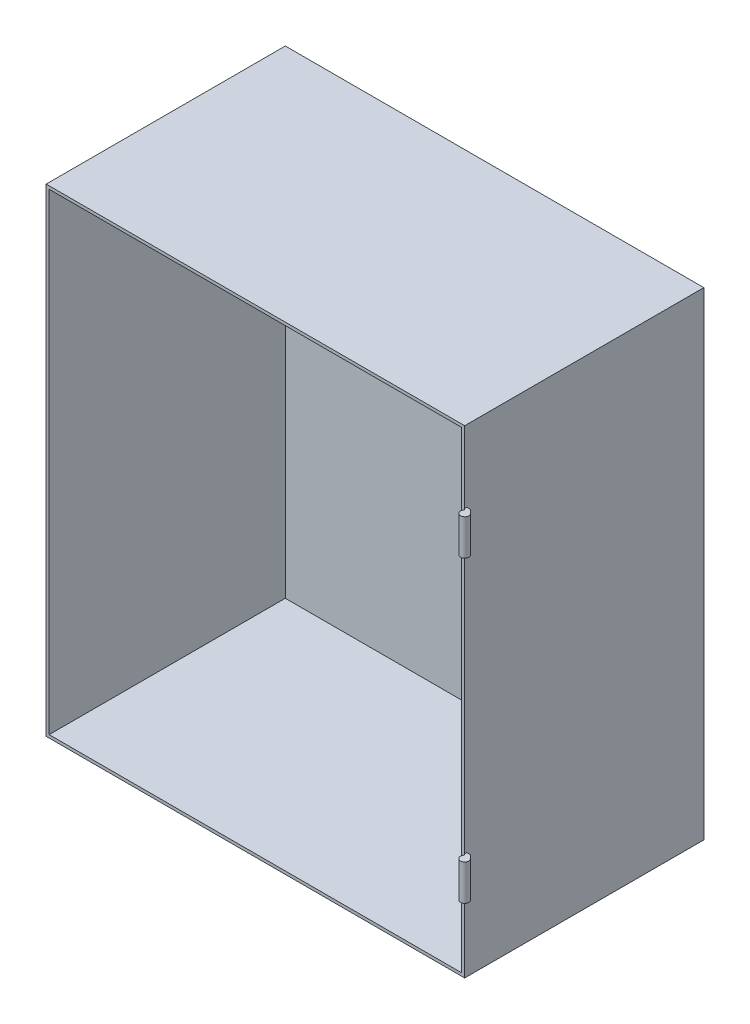
ISO-10303-21;
HEADER;
FILE_DESCRIPTION(('STEP AP214'),'2;1');
FILE_NAME('part.step','',(''),(''),'','','');
FILE_SCHEMA(('AUTOMOTIVE_DESIGN { 1 0 10303 214 1 1 1 1 }'));
ENDSEC;
DATA;
#1=APPLICATION_CONTEXT('core data for automotive mechanical design processes');
#2=APPLICATION_PROTOCOL_DEFINITION('international standard','automotive_design',2000,#1);
#3=PRODUCT_CONTEXT('',#1,'mechanical');
#4=PRODUCT('Part','Part','',(#3));
#5=PRODUCT_RELATED_PRODUCT_CATEGORY('part','',(#4));
#6=PRODUCT_DEFINITION_FORMATION('','',#4);
#7=PRODUCT_DEFINITION_CONTEXT('part definition',#1,'design');
#8=PRODUCT_DEFINITION('design','',#6,#7);
#9=PRODUCT_DEFINITION_SHAPE('','',#8);
#10=(LENGTH_UNIT() NAMED_UNIT(*) SI_UNIT(.MILLI.,.METRE.));
#11=(NAMED_UNIT(*) PLANE_ANGLE_UNIT() SI_UNIT($,.RADIAN.));
#12=(NAMED_UNIT(*) SI_UNIT($,.STERADIAN.) SOLID_ANGLE_UNIT());
#13=UNCERTAINTY_MEASURE_WITH_UNIT(LENGTH_MEASURE(1.E-05),#10,'distance_accuracy_value','');
#14=(GEOMETRIC_REPRESENTATION_CONTEXT(3) GLOBAL_UNCERTAINTY_ASSIGNED_CONTEXT((#13)) GLOBAL_UNIT_ASSIGNED_CONTEXT((#10,
#11,#12)) REPRESENTATION_CONTEXT('',''));
#15=CARTESIAN_POINT('',(0.,0.,0.));
#16=DIRECTION('',(0.,0.,1.));
#17=DIRECTION('',(1.,0.,0.));
#18=AXIS2_PLACEMENT_3D('',#15,#16,#17);
#19=CARTESIAN_POINT('',(700.,-822.375099851717,396.545914708176));
#20=DIRECTION('',(0.,0.,-1.));
#21=DIRECTION('',(-1.,0.,0.));
#22=AXIS2_PLACEMENT_3D('',#19,#20,#21);
#23=PLANE('',#22);
#24=DIRECTION('',(1.,0.,0.));
#25=VECTOR('',#24,1.);
#26=CARTESIAN_POINT('',(700.,-680.,396.545914708176));
#27=LINE('',#26,#25);
#28=CARTESIAN_POINT('',(700.,-680.,396.545914708176));
#29=VERTEX_POINT('',#28);
#30=CARTESIAN_POINT('',(706.,-680.,396.545914708176));
#31=VERTEX_POINT('',#30);
#32=EDGE_CURVE('E307',#29,#31,#27,.T.);
#33=ORIENTED_EDGE('',*,*,#32,.F.);
#34=DIRECTION('',(0.,1.,0.));
#35=VECTOR('',#34,1.);
#36=CARTESIAN_POINT('',(700.,-822.375099851717,396.545914708176));
#37=LINE('',#36,#35);
#38=CARTESIAN_POINT('',(700.,-620.,396.545914708176));
#39=VERTEX_POINT('',#38);
#40=EDGE_CURVE('E257',#29,#39,#37,.T.);
#41=ORIENTED_EDGE('',*,*,#40,.T.);
#42=DIRECTION('',(-1.,0.,0.));
#43=VECTOR('',#42,1.);
#44=CARTESIAN_POINT('',(700.,-620.,396.545914708176));
#45=LINE('',#44,#43);
#46=CARTESIAN_POINT('',(706.,-620.,396.545914708176));
#47=VERTEX_POINT('',#46);
#48=EDGE_CURVE('E302',#47,#39,#45,.T.);
#49=ORIENTED_EDGE('',*,*,#48,.F.);
#50=DIRECTION('',(0.,1.,0.));
#51=VECTOR('',#50,1.);
#52=CARTESIAN_POINT('',(706.,-822.375099851717,396.545914708176));
#53=LINE('',#52,#51);
#54=EDGE_CURVE('E319',#31,#47,#53,.T.);
#55=ORIENTED_EDGE('',*,*,#54,.F.);
#56=EDGE_LOOP('',(#33,#41,#49,#55));
#57=FACE_BOUND('',#56,.T.);
#58=ADVANCED_FACE('F33',(#57),#23,.T.);
#59=CARTESIAN_POINT('',(706.,-822.375099851717,396.545914708176));
#60=DIRECTION('',(0.707106781186547,0.,-0.707106781186547));
#61=DIRECTION('',(-0.707106781186548,0.,-0.707106781186548));
#62=AXIS2_PLACEMENT_3D('',#59,#60,#61);
#63=PLANE('',#62);
#64=DIRECTION('',(0.707106781186548,0.,0.707106781186548));
#65=VECTOR('',#64,1.);
#66=CARTESIAN_POINT('',(706.,-680.,396.545914708176));
#67=LINE('',#66,#65);
#68=CARTESIAN_POINT('',(710.25902771965,-680.,400.804942427826));
#69=VERTEX_POINT('',#68);
#70=EDGE_CURVE('E305',#31,#69,#67,.T.);
#71=ORIENTED_EDGE('',*,*,#70,.F.);
#72=ORIENTED_EDGE('',*,*,#54,.T.);
#73=DIRECTION('',(-0.707106781186548,0.,-0.707106781186548));
#74=VECTOR('',#73,1.);
#75=CARTESIAN_POINT('',(706.,-620.,396.545914708176));
#76=LINE('',#75,#74);
#77=CARTESIAN_POINT('',(710.25902771965,-620.,400.804942427826));
#78=VERTEX_POINT('',#77);
#79=EDGE_CURVE('E300',#78,#47,#76,.T.);
#80=ORIENTED_EDGE('',*,*,#79,.F.);
#81=DIRECTION('',(0.,1.,0.));
#82=VECTOR('',#81,1.);
#83=CARTESIAN_POINT('',(710.25902771965,-822.375099851717,400.804942427826));
#84=LINE('',#83,#82);
#85=EDGE_CURVE('E235',#69,#78,#84,.T.);
#86=ORIENTED_EDGE('',*,*,#85,.F.);
#87=EDGE_LOOP('',(#71,#72,#80,#86));
#88=FACE_BOUND('',#87,.T.);
#89=ADVANCED_FACE('F331',(#88),#63,.T.);
#90=CARTESIAN_POINT('',(707.,-822.375099851717,407.));
#91=DIRECTION('',(0.,1.,0.));
#92=DIRECTION('',(0.,0.,1.));
#93=AXIS2_PLACEMENT_3D('',#90,#91,#92);
#94=CYLINDRICAL_SURFACE('',#93,7.00000000000004);
#95=DIRECTION('',(0.,1.,0.));
#96=VECTOR('',#95,1.);
#97=CARTESIAN_POINT('',(702.050252531694,-822.375099851717,402.050252531694));
#98=LINE('',#97,#96);
#99=CARTESIAN_POINT('',(702.050252531694,-680.,402.050252531694));
#100=VERTEX_POINT('',#99);
#101=CARTESIAN_POINT('',(702.050252531694,-620.,402.050252531694));
#102=VERTEX_POINT('',#101);
#103=EDGE_CURVE('E229',#100,#102,#98,.T.);
#104=ORIENTED_EDGE('',*,*,#103,.F.);
#105=CARTESIAN_POINT('',(707.,-680.,407.));
#106=DIRECTION('',(0.,1.,0.));
#107=DIRECTION('',(0.,0.,1.));
#108=AXIS2_PLACEMENT_3D('',#105,#106,#107);
#109=CIRCLE('',#108,7.00000000000004);
#110=EDGE_CURVE('E55',#69,#100,#109,.F.);
#111=ORIENTED_EDGE('',*,*,#110,.F.);
#112=ORIENTED_EDGE('',*,*,#85,.T.);
#113=CARTESIAN_POINT('',(707.,-620.,407.));
#114=DIRECTION('',(0.,-1.,0.));
#115=DIRECTION('',(0.,0.,-1.));
#116=AXIS2_PLACEMENT_3D('',#113,#114,#115);
#117=CIRCLE('',#116,7.00000000000004);
#118=EDGE_CURVE('E225',#102,#78,#117,.F.);
#119=ORIENTED_EDGE('',*,*,#118,.F.);
#120=EDGE_LOOP('',(#104,#111,#112,#119));
#121=FACE_BOUND('',#120,.T.);
#122=ADVANCED_FACE('F328',(#121),#94,.T.);
#123=CARTESIAN_POINT('',(700.,-822.375099851717,400.));
#124=DIRECTION('',(-0.707106781186557,0.,0.707106781186538));
#125=DIRECTION('',(0.707106781186538,0.,0.707106781186557));
#126=AXIS2_PLACEMENT_3D('',#123,#124,#125);
#127=PLANE('',#126);
#128=DIRECTION('',(-0.707106781186538,0.,-0.707106781186557));
#129=VECTOR('',#128,1.);
#130=CARTESIAN_POINT('',(700.,-680.,400.));
#131=LINE('',#130,#129);
#132=CARTESIAN_POINT('',(700.,-680.,400.));
#133=VERTEX_POINT('',#132);
#134=EDGE_CURVE('E11',#100,#133,#131,.T.);
#135=ORIENTED_EDGE('',*,*,#134,.F.);
#136=ORIENTED_EDGE('',*,*,#103,.T.);
#137=DIRECTION('',(0.707106781186538,0.,0.707106781186557));
#138=VECTOR('',#137,1.);
#139=CARTESIAN_POINT('',(700.,-620.,400.));
#140=LINE('',#139,#138);
#141=CARTESIAN_POINT('',(700.,-620.,400.));
#142=VERTEX_POINT('',#141);
#143=EDGE_CURVE('E41',#142,#102,#140,.T.);
#144=ORIENTED_EDGE('',*,*,#143,.F.);
#145=DIRECTION('',(0.,1.,0.));
#146=VECTOR('',#145,1.);
#147=CARTESIAN_POINT('',(700.,0.,400.));
#148=LINE('',#147,#146);
#149=EDGE_CURVE('E190',#133,#142,#148,.T.);
#150=ORIENTED_EDGE('',*,*,#149,.F.);
#151=EDGE_LOOP('',(#135,#136,#144,#150));
#152=FACE_BOUND('',#151,.T.);
#153=ADVANCED_FACE('F230',(#152),#127,.T.);
#154=CARTESIAN_POINT('',(0.,0.,400.));
#155=DIRECTION('',(1.,0.,0.));
#156=DIRECTION('',(0.,0.,-1.));
#157=AXIS2_PLACEMENT_3D('',#154,#155,#156);
#158=PLANE('',#157);
#159=DIRECTION('',(0.,-1.,0.));
#160=VECTOR('',#159,1.);
#161=CARTESIAN_POINT('',(0.,0.,0.));
#162=LINE('',#161,#160);
#163=CARTESIAN_POINT('',(0.,0.,0.));
#164=VERTEX_POINT('',#163);
#165=CARTESIAN_POINT('',(0.,-800.,0.));
#166=VERTEX_POINT('',#165);
#167=EDGE_CURVE('E198',#164,#166,#162,.T.);
#168=ORIENTED_EDGE('',*,*,#167,.T.);
#169=DIRECTION('',(0.,0.,-1.));
#170=VECTOR('',#169,1.);
#171=CARTESIAN_POINT('',(0.,-800.,400.));
#172=LINE('',#171,#170);
#173=CARTESIAN_POINT('',(0.,-800.,400.));
#174=VERTEX_POINT('',#173);
#175=EDGE_CURVE('E217',#174,#166,#172,.T.);
#176=ORIENTED_EDGE('',*,*,#175,.F.);
#177=DIRECTION('',(0.,-1.,0.));
#178=VECTOR('',#177,1.);
#179=CARTESIAN_POINT('',(0.,0.,400.));
#180=LINE('',#179,#178);
#181=CARTESIAN_POINT('',(0.,0.,400.));
#182=VERTEX_POINT('',#181);
#183=EDGE_CURVE('E209',#182,#174,#180,.T.);
#184=ORIENTED_EDGE('',*,*,#183,.F.);
#185=DIRECTION('',(0.,0.,-1.));
#186=VECTOR('',#185,1.);
#187=CARTESIAN_POINT('',(0.,0.,400.));
#188=LINE('',#187,#186);
#189=EDGE_CURVE('E197',#182,#164,#188,.T.);
#190=ORIENTED_EDGE('',*,*,#189,.T.);
#191=EDGE_LOOP('',(#168,#176,#184,#190));
#192=FACE_BOUND('',#191,.T.);
#193=ADVANCED_FACE('F35',(#192),#158,.F.);
#194=CARTESIAN_POINT('',(0.,-800.,400.));
#195=DIRECTION('',(0.,1.,0.));
#196=DIRECTION('',(0.,0.,1.));
#197=AXIS2_PLACEMENT_3D('',#194,#195,#196);
#198=PLANE('',#197);
#199=DIRECTION('',(0.,0.,-1.));
#200=VECTOR('',#199,1.);
#201=CARTESIAN_POINT('',(700.,-800.,400.));
#202=LINE('',#201,#200);
#203=CARTESIAN_POINT('',(700.,-800.,400.));
#204=VERTEX_POINT('',#203);
#205=CARTESIAN_POINT('',(700.,-800.,0.));
#206=VERTEX_POINT('',#205);
#207=EDGE_CURVE('E215',#204,#206,#202,.T.);
#208=ORIENTED_EDGE('',*,*,#207,.F.);
#209=DIRECTION('',(1.,0.,0.));
#210=VECTOR('',#209,1.);
#211=CARTESIAN_POINT('',(0.,-800.,400.));
#212=LINE('',#211,#210);
#213=EDGE_CURVE('E194',#174,#204,#212,.T.);
#214=ORIENTED_EDGE('',*,*,#213,.F.);
#215=ORIENTED_EDGE('',*,*,#175,.T.);
#216=DIRECTION('',(1.,0.,0.));
#217=VECTOR('',#216,1.);
#218=CARTESIAN_POINT('',(0.,-800.,0.));
#219=LINE('',#218,#217);
#220=EDGE_CURVE('E201',#166,#206,#219,.T.);
#221=ORIENTED_EDGE('',*,*,#220,.T.);
#222=EDGE_LOOP('',(#208,#214,#215,#221));
#223=FACE_BOUND('',#222,.T.);
#224=ADVANCED_FACE('F283',(#223),#198,.F.);
#225=CARTESIAN_POINT('',(700.,0.,400.));
#226=DIRECTION('',(-1.,0.,0.));
#227=DIRECTION('',(0.,-1.,0.));
#228=AXIS2_PLACEMENT_3D('',#225,#226,#227);
#229=PLANE('',#228);
#230=CARTESIAN_POINT('',(700.,-180.,396.545914708176));
#231=VERTEX_POINT('',#230);
#232=CARTESIAN_POINT('',(700.,-120.,396.545914708176));
#233=VERTEX_POINT('',#232);
#234=EDGE_CURVE('E172',#231,#233,#37,.T.);
#235=ORIENTED_EDGE('',*,*,#234,.F.);
#236=DIRECTION('',(0.,0.,-1.));
#237=VECTOR('',#236,1.);
#238=CARTESIAN_POINT('',(700.,-180.,450.));
#239=LINE('',#238,#237);
#240=CARTESIAN_POINT('',(700.,-180.,400.));
#241=VERTEX_POINT('',#240);
#242=EDGE_CURVE('E157',#241,#231,#239,.T.);
#243=ORIENTED_EDGE('',*,*,#242,.F.);
#244=EDGE_CURVE('E169',#142,#241,#148,.T.);
#245=ORIENTED_EDGE('',*,*,#244,.F.);
#246=DIRECTION('',(0.,0.,-1.));
#247=VECTOR('',#246,1.);
#248=CARTESIAN_POINT('',(700.,-620.,450.));
#249=LINE('',#248,#247);
#250=EDGE_CURVE('E173',#142,#39,#249,.T.);
#251=ORIENTED_EDGE('',*,*,#250,.T.);
#252=ORIENTED_EDGE('',*,*,#40,.F.);
#253=DIRECTION('',(0.,0.,-1.));
#254=VECTOR('',#253,1.);
#255=CARTESIAN_POINT('',(700.,-680.,450.));
#256=LINE('',#255,#254);
#257=EDGE_CURVE('E288',#133,#29,#256,.T.);
#258=ORIENTED_EDGE('',*,*,#257,.F.);
#259=EDGE_CURVE('E184',#204,#133,#148,.T.);
#260=ORIENTED_EDGE('',*,*,#259,.F.);
#261=ORIENTED_EDGE('',*,*,#207,.T.);
#262=DIRECTION('',(0.,1.,0.));
#263=VECTOR('',#262,1.);
#264=CARTESIAN_POINT('',(700.,0.,0.));
#265=LINE('',#264,#263);
#266=CARTESIAN_POINT('',(700.,0.,0.));
#267=VERTEX_POINT('',#266);
#268=EDGE_CURVE('E205',#206,#267,#265,.T.);
#269=ORIENTED_EDGE('',*,*,#268,.T.);
#270=DIRECTION('',(0.,0.,-1.));
#271=VECTOR('',#270,1.);
#272=CARTESIAN_POINT('',(700.,0.,400.));
#273=LINE('',#272,#271);
#274=CARTESIAN_POINT('',(700.,0.,400.));
#275=VERTEX_POINT('',#274);
#276=EDGE_CURVE('E212',#275,#267,#273,.T.);
#277=ORIENTED_EDGE('',*,*,#276,.F.);
#278=CARTESIAN_POINT('',(700.,-120.,400.));
#279=VERTEX_POINT('',#278);
#280=EDGE_CURVE('E182',#279,#275,#148,.T.);
#281=ORIENTED_EDGE('',*,*,#280,.F.);
#282=DIRECTION('',(0.,0.,-1.));
#283=VECTOR('',#282,1.);
#284=CARTESIAN_POINT('',(700.,-120.,450.));
#285=LINE('',#284,#283);
#286=EDGE_CURVE('E309',#279,#233,#285,.T.);
#287=ORIENTED_EDGE('',*,*,#286,.T.);
#288=EDGE_LOOP('',(#235,#243,#245,#251,#252,#258,#260,#261,#269,#277,#281,#287));
#289=FACE_BOUND('',#288,.T.);
#290=ADVANCED_FACE('F166',(#289),#229,.F.);
#291=CARTESIAN_POINT('',(0.,0.,400.));
#292=DIRECTION('',(0.,-1.,0.));
#293=DIRECTION('',(0.,0.,-1.));
#294=AXIS2_PLACEMENT_3D('',#291,#292,#293);
#295=PLANE('',#294);
#296=DIRECTION('',(-1.,0.,0.));
#297=VECTOR('',#296,1.);
#298=CARTESIAN_POINT('',(0.,0.,400.));
#299=LINE('',#298,#297);
#300=EDGE_CURVE('E193',#275,#182,#299,.T.);
#301=ORIENTED_EDGE('',*,*,#300,.F.);
#302=ORIENTED_EDGE('',*,*,#276,.T.);
#303=DIRECTION('',(-1.,0.,0.));
#304=VECTOR('',#303,1.);
#305=CARTESIAN_POINT('',(0.,0.,0.));
#306=LINE('',#305,#304);
#307=EDGE_CURVE('E207',#267,#164,#306,.T.);
#308=ORIENTED_EDGE('',*,*,#307,.T.);
#309=ORIENTED_EDGE('',*,*,#189,.F.);
#310=EDGE_LOOP('',(#301,#302,#308,#309));
#311=FACE_BOUND('',#310,.T.);
#312=ADVANCED_FACE('F278',(#311),#295,.F.);
#313=CARTESIAN_POINT('',(0.,0.,400.));
#314=DIRECTION('',(0.,0.,1.));
#315=DIRECTION('',(1.,0.,0.));
#316=AXIS2_PLACEMENT_3D('',#313,#314,#315);
#317=PLANE('',#316);
#318=DIRECTION('',(-1.,0.,0.));
#319=VECTOR('',#318,1.);
#320=CARTESIAN_POINT('',(695.,-5.,400.));
#321=LINE('',#320,#319);
#322=CARTESIAN_POINT('',(695.,-5.,400.));
#323=VERTEX_POINT('',#322);
#324=CARTESIAN_POINT('',(5.,-5.,400.));
#325=VERTEX_POINT('',#324);
#326=EDGE_CURVE('E254',#323,#325,#321,.T.);
#327=ORIENTED_EDGE('',*,*,#326,.F.);
#328=DIRECTION('',(0.,1.,0.));
#329=VECTOR('',#328,1.);
#330=CARTESIAN_POINT('',(695.,-795.,400.));
#331=LINE('',#330,#329);
#332=CARTESIAN_POINT('',(695.,-795.,400.));
#333=VERTEX_POINT('',#332);
#334=EDGE_CURVE('E244',#333,#323,#331,.T.);
#335=ORIENTED_EDGE('',*,*,#334,.F.);
#336=DIRECTION('',(1.,0.,0.));
#337=VECTOR('',#336,1.);
#338=CARTESIAN_POINT('',(5.,-795.,400.));
#339=LINE('',#338,#337);
#340=CARTESIAN_POINT('',(5.,-795.,400.));
#341=VERTEX_POINT('',#340);
#342=EDGE_CURVE('E260',#341,#333,#339,.T.);
#343=ORIENTED_EDGE('',*,*,#342,.F.);
#344=DIRECTION('',(0.,-1.,0.));
#345=VECTOR('',#344,1.);
#346=CARTESIAN_POINT('',(5.,-5.,400.));
#347=LINE('',#346,#345);
#348=EDGE_CURVE('E256',#325,#341,#347,.T.);
#349=ORIENTED_EDGE('',*,*,#348,.F.);
#350=EDGE_LOOP('',(#327,#335,#343,#349));
#351=FACE_BOUND('',#350,.T.);
#352=ORIENTED_EDGE('',*,*,#183,.T.);
#353=ORIENTED_EDGE('',*,*,#213,.T.);
#354=ORIENTED_EDGE('',*,*,#259,.T.);
#355=ORIENTED_EDGE('',*,*,#149,.T.);
#356=ORIENTED_EDGE('',*,*,#244,.T.);
#357=EDGE_CURVE('E176',#241,#279,#148,.T.);
#358=ORIENTED_EDGE('',*,*,#357,.T.);
#359=ORIENTED_EDGE('',*,*,#280,.T.);
#360=ORIENTED_EDGE('',*,*,#300,.T.);
#361=EDGE_LOOP('',(#352,#353,#354,#355,#356,#358,#359,#360));
#362=FACE_BOUND('',#361,.T.);
#363=ADVANCED_FACE('F187',(#351,#362),#317,.T.);
#364=CARTESIAN_POINT('',(0.,0.,0.));
#365=DIRECTION('',(0.,0.,1.));
#366=DIRECTION('',(1.,0.,0.));
#367=AXIS2_PLACEMENT_3D('',#364,#365,#366);
#368=PLANE('',#367);
#369=ORIENTED_EDGE('',*,*,#167,.F.);
#370=ORIENTED_EDGE('',*,*,#307,.F.);
#371=ORIENTED_EDGE('',*,*,#268,.F.);
#372=ORIENTED_EDGE('',*,*,#220,.F.);
#373=EDGE_LOOP('',(#369,#370,#371,#372));
#374=FACE_BOUND('',#373,.T.);
#375=ADVANCED_FACE('F443',(#374),#368,.F.);
#376=CARTESIAN_POINT('',(695.,-5.,5.));
#377=DIRECTION('',(0.,1.,0.));
#378=DIRECTION('',(0.,0.,1.));
#379=AXIS2_PLACEMENT_3D('',#376,#377,#378);
#380=PLANE('',#379);
#381=ORIENTED_EDGE('',*,*,#326,.T.);
#382=DIRECTION('',(0.,0.,1.));
#383=VECTOR('',#382,1.);
#384=CARTESIAN_POINT('',(5.,-5.,5.));
#385=LINE('',#384,#383);
#386=CARTESIAN_POINT('',(5.,-5.,5.));
#387=VERTEX_POINT('',#386);
#388=EDGE_CURVE('E253',#387,#325,#385,.T.);
#389=ORIENTED_EDGE('',*,*,#388,.F.);
#390=DIRECTION('',(-1.,0.,0.));
#391=VECTOR('',#390,1.);
#392=CARTESIAN_POINT('',(695.,-5.,5.));
#393=LINE('',#392,#391);
#394=CARTESIAN_POINT('',(695.,-5.,5.));
#395=VERTEX_POINT('',#394);
#396=EDGE_CURVE('E240',#395,#387,#393,.T.);
#397=ORIENTED_EDGE('',*,*,#396,.F.);
#398=DIRECTION('',(0.,0.,1.));
#399=VECTOR('',#398,1.);
#400=CARTESIAN_POINT('',(695.,-5.,5.));
#401=LINE('',#400,#399);
#402=EDGE_CURVE('E202',#395,#323,#401,.T.);
#403=ORIENTED_EDGE('',*,*,#402,.T.);
#404=EDGE_LOOP('',(#381,#389,#397,#403));
#405=FACE_BOUND('',#404,.T.);
#406=ADVANCED_FACE('F433',(#405),#380,.F.);
#407=CARTESIAN_POINT('',(695.,-795.,5.));
#408=DIRECTION('',(1.,0.,0.));
#409=DIRECTION('',(0.,1.,0.));
#410=AXIS2_PLACEMENT_3D('',#407,#408,#409);
#411=PLANE('',#410);
#412=ORIENTED_EDGE('',*,*,#334,.T.);
#413=ORIENTED_EDGE('',*,*,#402,.F.);
#414=DIRECTION('',(0.,1.,0.));
#415=VECTOR('',#414,1.);
#416=CARTESIAN_POINT('',(695.,-795.,5.));
#417=LINE('',#416,#415);
#418=CARTESIAN_POINT('',(695.,-795.,5.));
#419=VERTEX_POINT('',#418);
#420=EDGE_CURVE('E250',#419,#395,#417,.T.);
#421=ORIENTED_EDGE('',*,*,#420,.F.);
#422=DIRECTION('',(0.,0.,1.));
#423=VECTOR('',#422,1.);
#424=CARTESIAN_POINT('',(695.,-795.,5.));
#425=LINE('',#424,#423);
#426=EDGE_CURVE('E266',#419,#333,#425,.T.);
#427=ORIENTED_EDGE('',*,*,#426,.T.);
#428=EDGE_LOOP('',(#412,#413,#421,#427));
#429=FACE_BOUND('',#428,.T.);
#430=ADVANCED_FACE('F423',(#429),#411,.F.);
#431=CARTESIAN_POINT('',(5.,-795.,5.));
#432=DIRECTION('',(0.,-1.,0.));
#433=DIRECTION('',(0.,0.,-1.));
#434=AXIS2_PLACEMENT_3D('',#431,#432,#433);
#435=PLANE('',#434);
#436=ORIENTED_EDGE('',*,*,#342,.T.);
#437=ORIENTED_EDGE('',*,*,#426,.F.);
#438=DIRECTION('',(1.,0.,0.));
#439=VECTOR('',#438,1.);
#440=CARTESIAN_POINT('',(5.,-795.,5.));
#441=LINE('',#440,#439);
#442=CARTESIAN_POINT('',(5.,-795.,5.));
#443=VERTEX_POINT('',#442);
#444=EDGE_CURVE('E247',#443,#419,#441,.T.);
#445=ORIENTED_EDGE('',*,*,#444,.F.);
#446=DIRECTION('',(0.,0.,1.));
#447=VECTOR('',#446,1.);
#448=CARTESIAN_POINT('',(5.,-795.,5.));
#449=LINE('',#448,#447);
#450=EDGE_CURVE('E268',#443,#341,#449,.T.);
#451=ORIENTED_EDGE('',*,*,#450,.T.);
#452=EDGE_LOOP('',(#436,#437,#445,#451));
#453=FACE_BOUND('',#452,.T.);
#454=ADVANCED_FACE('F413',(#453),#435,.F.);
#455=CARTESIAN_POINT('',(5.,-5.,5.));
#456=DIRECTION('',(-1.,0.,0.));
#457=DIRECTION('',(0.,0.,1.));
#458=AXIS2_PLACEMENT_3D('',#455,#456,#457);
#459=PLANE('',#458);
#460=ORIENTED_EDGE('',*,*,#348,.T.);
#461=ORIENTED_EDGE('',*,*,#450,.F.);
#462=DIRECTION('',(0.,-1.,0.));
#463=VECTOR('',#462,1.);
#464=CARTESIAN_POINT('',(5.,-5.,5.));
#465=LINE('',#464,#463);
#466=EDGE_CURVE('E243',#387,#443,#465,.T.);
#467=ORIENTED_EDGE('',*,*,#466,.F.);
#468=ORIENTED_EDGE('',*,*,#388,.T.);
#469=EDGE_LOOP('',(#460,#461,#467,#468));
#470=FACE_BOUND('',#469,.T.);
#471=ADVANCED_FACE('F361',(#470),#459,.F.);
#472=CARTESIAN_POINT('',(0.,0.,5.));
#473=DIRECTION('',(0.,0.,1.));
#474=DIRECTION('',(1.,0.,0.));
#475=AXIS2_PLACEMENT_3D('',#472,#473,#474);
#476=PLANE('',#475);
#477=ORIENTED_EDGE('',*,*,#396,.T.);
#478=ORIENTED_EDGE('',*,*,#466,.T.);
#479=ORIENTED_EDGE('',*,*,#444,.T.);
#480=ORIENTED_EDGE('',*,*,#420,.T.);
#481=EDGE_LOOP('',(#477,#478,#479,#480));
#482=FACE_BOUND('',#481,.T.);
#483=ADVANCED_FACE('F354',(#482),#476,.T.);
#484=DIRECTION('',(1.,0.,0.));
#485=VECTOR('',#484,1.);
#486=CARTESIAN_POINT('',(700.,-180.,396.545914708176));
#487=LINE('',#486,#485);
#488=CARTESIAN_POINT('',(706.,-180.,396.545914708176));
#489=VERTEX_POINT('',#488);
#490=EDGE_CURVE('E297',#231,#489,#487,.T.);
#491=ORIENTED_EDGE('',*,*,#490,.F.);
#492=ORIENTED_EDGE('',*,*,#234,.T.);
#493=DIRECTION('',(-1.,0.,0.));
#494=VECTOR('',#493,1.);
#495=CARTESIAN_POINT('',(700.,-120.,396.545914708176));
#496=LINE('',#495,#494);
#497=CARTESIAN_POINT('',(706.,-120.,396.545914708176));
#498=VERTEX_POINT('',#497);
#499=EDGE_CURVE('E237',#498,#233,#496,.T.);
#500=ORIENTED_EDGE('',*,*,#499,.F.);
#501=EDGE_CURVE('E320',#489,#498,#53,.T.);
#502=ORIENTED_EDGE('',*,*,#501,.F.);
#503=EDGE_LOOP('',(#491,#492,#500,#502));
#504=FACE_BOUND('',#503,.T.);
#505=ADVANCED_FACE('F345',(#504),#23,.T.);
#506=DIRECTION('',(0.707106781186548,0.,0.707106781186548));
#507=VECTOR('',#506,1.);
#508=CARTESIAN_POINT('',(706.,-180.,396.545914708176));
#509=LINE('',#508,#507);
#510=CARTESIAN_POINT('',(710.25902771965,-180.,400.804942427826));
#511=VERTEX_POINT('',#510);
#512=EDGE_CURVE('E292',#489,#511,#509,.T.);
#513=ORIENTED_EDGE('',*,*,#512,.F.);
#514=ORIENTED_EDGE('',*,*,#501,.T.);
#515=DIRECTION('',(-0.707106781186548,0.,-0.707106781186548));
#516=VECTOR('',#515,1.);
#517=CARTESIAN_POINT('',(706.,-120.,396.545914708176));
#518=LINE('',#517,#516);
#519=CARTESIAN_POINT('',(710.25902771965,-120.,400.804942427826));
#520=VERTEX_POINT('',#519);
#521=EDGE_CURVE('E314',#520,#498,#518,.T.);
#522=ORIENTED_EDGE('',*,*,#521,.F.);
#523=EDGE_CURVE('E232',#511,#520,#84,.T.);
#524=ORIENTED_EDGE('',*,*,#523,.F.);
#525=EDGE_LOOP('',(#513,#514,#522,#524));
#526=FACE_BOUND('',#525,.T.);
#527=ADVANCED_FACE('F351',(#526),#63,.T.);
#528=CARTESIAN_POINT('',(702.050252531694,-180.,402.050252531694));
#529=VERTEX_POINT('',#528);
#530=CARTESIAN_POINT('',(702.050252531694,-120.,402.050252531694));
#531=VERTEX_POINT('',#530);
#532=EDGE_CURVE('E233',#529,#531,#98,.T.);
#533=ORIENTED_EDGE('',*,*,#532,.F.);
#534=CARTESIAN_POINT('',(707.,-180.,407.));
#535=DIRECTION('',(0.,1.,0.));
#536=DIRECTION('',(0.,0.,1.));
#537=AXIS2_PLACEMENT_3D('',#534,#535,#536);
#538=CIRCLE('',#537,7.00000000000004);
#539=EDGE_CURVE('E48',#511,#529,#538,.F.);
#540=ORIENTED_EDGE('',*,*,#539,.F.);
#541=ORIENTED_EDGE('',*,*,#523,.T.);
#542=CARTESIAN_POINT('',(707.,-120.,407.));
#543=DIRECTION('',(0.,-1.,0.));
#544=DIRECTION('',(1.,0.,0.));
#545=AXIS2_PLACEMENT_3D('',#542,#543,#544);
#546=CIRCLE('',#545,7.00000000000004);
#547=EDGE_CURVE('E311',#531,#520,#546,.F.);
#548=ORIENTED_EDGE('',*,*,#547,.F.);
#549=EDGE_LOOP('',(#533,#540,#541,#548));
#550=FACE_BOUND('',#549,.T.);
#551=ADVANCED_FACE('F360',(#550),#94,.T.);
#552=DIRECTION('',(-0.707106781186538,0.,-0.707106781186557));
#553=VECTOR('',#552,1.);
#554=CARTESIAN_POINT('',(700.,-180.,400.));
#555=LINE('',#554,#553);
#556=EDGE_CURVE('E154',#529,#241,#555,.T.);
#557=ORIENTED_EDGE('',*,*,#556,.F.);
#558=ORIENTED_EDGE('',*,*,#532,.T.);
#559=DIRECTION('',(0.707106781186538,0.,0.707106781186557));
#560=VECTOR('',#559,1.);
#561=CARTESIAN_POINT('',(700.,-120.,400.));
#562=LINE('',#561,#560);
#563=EDGE_CURVE('E162',#279,#531,#562,.T.);
#564=ORIENTED_EDGE('',*,*,#563,.F.);
#565=ORIENTED_EDGE('',*,*,#357,.F.);
#566=EDGE_LOOP('',(#557,#558,#564,#565));
#567=FACE_BOUND('',#566,.T.);
#568=ADVANCED_FACE('F177',(#567),#127,.T.);
#569=CARTESIAN_POINT('',(700.,-120.,450.));
#570=DIRECTION('',(0.,-1.,0.));
#571=DIRECTION('',(1.,0.,0.));
#572=AXIS2_PLACEMENT_3D('',#569,#570,#571);
#573=PLANE('',#572);
#574=ORIENTED_EDGE('',*,*,#499,.T.);
#575=ORIENTED_EDGE('',*,*,#286,.F.);
#576=ORIENTED_EDGE('',*,*,#563,.T.);
#577=ORIENTED_EDGE('',*,*,#547,.T.);
#578=ORIENTED_EDGE('',*,*,#521,.T.);
#579=EDGE_LOOP('',(#574,#575,#576,#577,#578));
#580=FACE_BOUND('',#579,.T.);
#581=ADVANCED_FACE('F369',(#580),#573,.F.);
#582=CARTESIAN_POINT('',(756.68698908302,-620.,450.));
#583=DIRECTION('',(0.,-1.,0.));
#584=DIRECTION('',(0.,0.,-1.));
#585=AXIS2_PLACEMENT_3D('',#582,#583,#584);
#586=PLANE('',#585);
#587=ORIENTED_EDGE('',*,*,#48,.T.);
#588=ORIENTED_EDGE('',*,*,#250,.F.);
#589=ORIENTED_EDGE('',*,*,#143,.T.);
#590=ORIENTED_EDGE('',*,*,#118,.T.);
#591=ORIENTED_EDGE('',*,*,#79,.T.);
#592=EDGE_LOOP('',(#587,#588,#589,#590,#591));
#593=FACE_BOUND('',#592,.T.);
#594=ADVANCED_FACE('F224',(#593),#586,.F.);
#595=CARTESIAN_POINT('',(756.68698908302,-180.,450.));
#596=DIRECTION('',(0.,1.,0.));
#597=DIRECTION('',(0.,0.,1.));
#598=AXIS2_PLACEMENT_3D('',#595,#596,#597);
#599=PLANE('',#598);
#600=ORIENTED_EDGE('',*,*,#490,.T.);
#601=ORIENTED_EDGE('',*,*,#512,.T.);
#602=ORIENTED_EDGE('',*,*,#539,.T.);
#603=ORIENTED_EDGE('',*,*,#556,.T.);
#604=ORIENTED_EDGE('',*,*,#242,.T.);
#605=EDGE_LOOP('',(#600,#601,#602,#603,#604));
#606=FACE_BOUND('',#605,.T.);
#607=ADVANCED_FACE('F156',(#606),#599,.F.);
#608=CARTESIAN_POINT('',(700.,-680.,450.));
#609=DIRECTION('',(0.,1.,0.));
#610=DIRECTION('',(0.,0.,1.));
#611=AXIS2_PLACEMENT_3D('',#608,#609,#610);
#612=PLANE('',#611);
#613=ORIENTED_EDGE('',*,*,#32,.T.);
#614=ORIENTED_EDGE('',*,*,#70,.T.);
#615=ORIENTED_EDGE('',*,*,#110,.T.);
#616=ORIENTED_EDGE('',*,*,#134,.T.);
#617=ORIENTED_EDGE('',*,*,#257,.T.);
#618=EDGE_LOOP('',(#613,#614,#615,#616,#617));
#619=FACE_BOUND('',#618,.T.);
#620=ADVANCED_FACE('F335',(#619),#612,.F.);
#621=CLOSED_SHELL('',(#58,#89,#122,#153,#193,#224,#290,#312,#363,#375,#406,#430,#454,#471,#483,
#505,#527,#551,#568,#581,#594,#607,#620));
#622=MANIFOLD_SOLID_BREP('B2',#621);
#623=ADVANCED_BREP_SHAPE_REPRESENTATION('',(#18,#622),#14);
#624=SHAPE_DEFINITION_REPRESENTATION(#9,#623);
ENDSEC;
END-ISO-10303-21;
